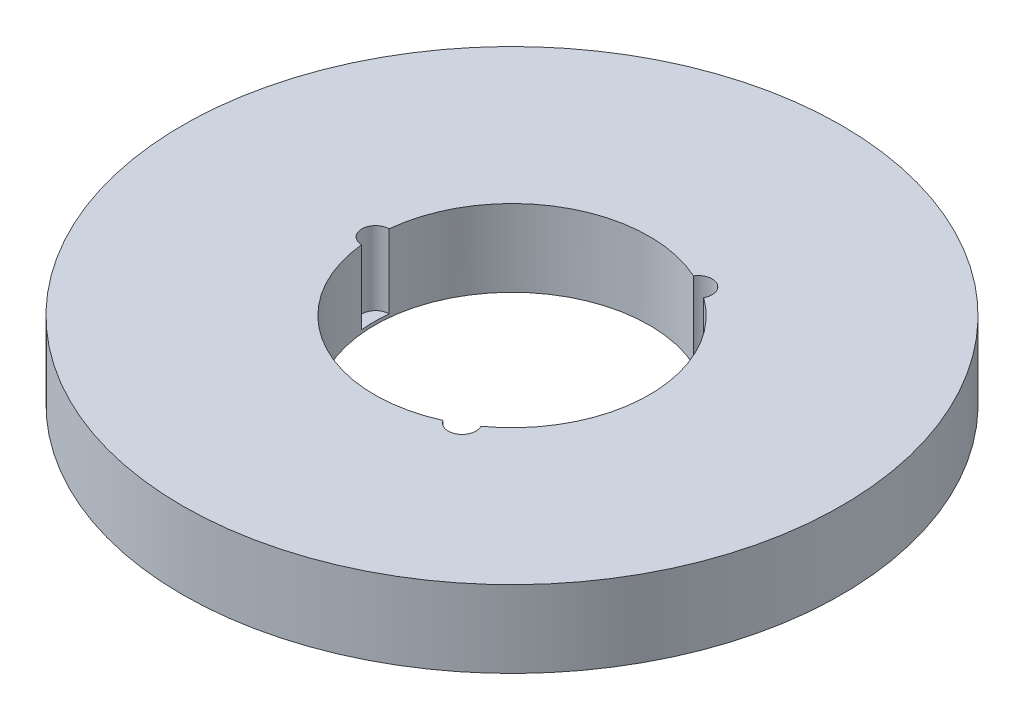
ISO-10303-21;
HEADER;
FILE_DESCRIPTION(('STEP AP214'),'2;1');
FILE_NAME('part.step','',(''),(''),'','','');
FILE_SCHEMA(('AUTOMOTIVE_DESIGN { 1 0 10303 214 1 1 1 1 }'));
ENDSEC;
DATA;
#1=APPLICATION_CONTEXT('core data for automotive mechanical design processes');
#2=APPLICATION_PROTOCOL_DEFINITION('international standard','automotive_design',2000,#1);
#3=PRODUCT_CONTEXT('',#1,'mechanical');
#4=PRODUCT('Part','Part','',(#3));
#5=PRODUCT_RELATED_PRODUCT_CATEGORY('part','',(#4));
#6=PRODUCT_DEFINITION_FORMATION('','',#4);
#7=PRODUCT_DEFINITION_CONTEXT('part definition',#1,'design');
#8=PRODUCT_DEFINITION('design','',#6,#7);
#9=PRODUCT_DEFINITION_SHAPE('','',#8);
#10=(LENGTH_UNIT() NAMED_UNIT(*) SI_UNIT(.MILLI.,.METRE.));
#11=(NAMED_UNIT(*) PLANE_ANGLE_UNIT() SI_UNIT($,.RADIAN.));
#12=(NAMED_UNIT(*) SI_UNIT($,.STERADIAN.) SOLID_ANGLE_UNIT());
#13=UNCERTAINTY_MEASURE_WITH_UNIT(LENGTH_MEASURE(1.E-05),#10,'distance_accuracy_value','');
#14=(GEOMETRIC_REPRESENTATION_CONTEXT(3) GLOBAL_UNCERTAINTY_ASSIGNED_CONTEXT((#13)) GLOBAL_UNIT_ASSIGNED_CONTEXT((#10,
#11,#12)) REPRESENTATION_CONTEXT('',''));
#15=CARTESIAN_POINT('',(0.,0.,0.));
#16=DIRECTION('',(0.,0.,1.));
#17=DIRECTION('',(1.,0.,0.));
#18=AXIS2_PLACEMENT_3D('',#15,#16,#17);
#19=CARTESIAN_POINT('',(0.,14.,0.));
#20=DIRECTION('',(0.,-1.,0.));
#21=DIRECTION('',(0.,0.,-1.));
#22=AXIS2_PLACEMENT_3D('',#19,#20,#21);
#23=CYLINDRICAL_SURFACE('',#22,60.);
#24=CARTESIAN_POINT('',(0.,14.,0.));
#25=DIRECTION('',(0.,1.,0.));
#26=DIRECTION('',(0.,0.,1.));
#27=AXIS2_PLACEMENT_3D('',#24,#25,#26);
#28=CIRCLE('',#27,60.);
#29=CARTESIAN_POINT('',(0.,14.,60.));
#30=VERTEX_POINT('',#29);
#31=EDGE_CURVE('E130',#30,#30,#28,.T.);
#32=ORIENTED_EDGE('',*,*,#31,.F.);
#33=EDGE_LOOP('',(#32));
#34=FACE_BOUND('',#33,.T.);
#35=CARTESIAN_POINT('',(0.,0.,0.));
#36=DIRECTION('',(0.,1.,0.));
#37=DIRECTION('',(0.,0.,1.));
#38=AXIS2_PLACEMENT_3D('',#35,#36,#37);
#39=CIRCLE('',#38,60.);
#40=CARTESIAN_POINT('',(0.,0.,60.));
#41=VERTEX_POINT('',#40);
#42=EDGE_CURVE('E117',#41,#41,#39,.T.);
#43=ORIENTED_EDGE('',*,*,#42,.T.);
#44=EDGE_LOOP('',(#43));
#45=FACE_BOUND('',#44,.T.);
#46=ADVANCED_FACE('F39',(#34,#45),#23,.T.);
#47=CARTESIAN_POINT('',(0.,14.,0.));
#48=DIRECTION('',(0.,1.,0.));
#49=DIRECTION('',(0.,0.,1.));
#50=AXIS2_PLACEMENT_3D('',#47,#48,#49);
#51=PLANE('',#50);
#52=CARTESIAN_POINT('',(12.411815993931,14.,21.4978959156842));
#53=DIRECTION('',(0.,1.,0.));
#54=DIRECTION('',(0.866025403784436,0.,-0.500000000000004));
#55=AXIS2_PLACEMENT_3D('',#52,#53,#54);
#56=CIRCLE('',#55,2.51555012298367);
#57=CARTESIAN_POINT('',(10.2584758562214,14.,22.7983261031884));
#58=VERTEX_POINT('',#57);
#59=CARTESIAN_POINT('',(14.6146916410125,14.,20.2832637471911));
#60=VERTEX_POINT('',#59);
#61=EDGE_CURVE('E148',#58,#60,#56,.T.);
#62=ORIENTED_EDGE('',*,*,#61,.F.);
#63=CARTESIAN_POINT('',(0.,14.,0.));
#64=DIRECTION('',(0.,1.,0.));
#65=DIRECTION('',(0.,0.,1.));
#66=AXIS2_PLACEMENT_3D('',#63,#64,#65);
#67=CIRCLE('',#66,25.);
#68=CARTESIAN_POINT('',(-24.8731674972338,14.,2.51506235599725));
#69=VERTEX_POINT('',#68);
#70=EDGE_CURVE('E113',#69,#58,#67,.T.);
#71=ORIENTED_EDGE('',*,*,#70,.F.);
#72=CARTESIAN_POINT('',(-24.8236319878617,14.,0.));
#73=DIRECTION('',(0.,1.,0.));
#74=DIRECTION('',(0.,0.,1.));
#75=AXIS2_PLACEMENT_3D('',#72,#73,#74);
#76=CIRCLE('',#75,2.51555012298367);
#77=CARTESIAN_POINT('',(-24.8731674972338,14.,-2.51506235599725));
#78=VERTEX_POINT('',#77);
#79=EDGE_CURVE('E125',#78,#69,#76,.T.);
#80=ORIENTED_EDGE('',*,*,#79,.F.);
#81=CARTESIAN_POINT('',(10.2584758562211,14.,-22.7983261031886));
#82=VERTEX_POINT('',#81);
#83=EDGE_CURVE('E107',#82,#78,#67,.T.);
#84=ORIENTED_EDGE('',*,*,#83,.F.);
#85=CARTESIAN_POINT('',(12.4118159939307,14.,-21.4978959156844));
#86=DIRECTION('',(0.,1.,0.));
#87=DIRECTION('',(-0.866025403784443,0.,-0.499999999999992));
#88=AXIS2_PLACEMENT_3D('',#85,#86,#87);
#89=CIRCLE('',#88,2.51555012298367);
#90=CARTESIAN_POINT('',(14.6146916410122,14.,-20.2832637471913));
#91=VERTEX_POINT('',#90);
#92=EDGE_CURVE('E95',#91,#82,#89,.T.);
#93=ORIENTED_EDGE('',*,*,#92,.F.);
#94=EDGE_CURVE('E106',#60,#91,#67,.T.);
#95=ORIENTED_EDGE('',*,*,#94,.F.);
#96=EDGE_LOOP('',(#62,#71,#80,#84,#93,#95));
#97=FACE_BOUND('',#96,.T.);
#98=ORIENTED_EDGE('',*,*,#31,.T.);
#99=EDGE_LOOP('',(#98));
#100=FACE_BOUND('',#99,.T.);
#101=ADVANCED_FACE('F102',(#97,#100),#51,.T.);
#102=CARTESIAN_POINT('',(0.,0.,0.));
#103=DIRECTION('',(0.,1.,0.));
#104=DIRECTION('',(0.,0.,1.));
#105=AXIS2_PLACEMENT_3D('',#102,#103,#104);
#106=PLANE('',#105);
#107=CARTESIAN_POINT('',(0.,0.,0.));
#108=DIRECTION('',(0.,1.,0.));
#109=DIRECTION('',(0.,0.,1.));
#110=AXIS2_PLACEMENT_3D('',#107,#108,#109);
#111=CIRCLE('',#110,25.);
#112=CARTESIAN_POINT('',(0.,0.,25.));
#113=VERTEX_POINT('',#112);
#114=EDGE_CURVE('E118',#113,#113,#111,.T.);
#115=ORIENTED_EDGE('',*,*,#114,.T.);
#116=EDGE_LOOP('',(#115));
#117=FACE_BOUND('',#116,.T.);
#118=ORIENTED_EDGE('',*,*,#42,.F.);
#119=EDGE_LOOP('',(#118));
#120=FACE_BOUND('',#119,.T.);
#121=ADVANCED_FACE('F161',(#117,#120),#106,.F.);
#122=CARTESIAN_POINT('',(0.,14.,0.));
#123=DIRECTION('',(0.,-1.,0.));
#124=DIRECTION('',(0.,0.,-1.));
#125=AXIS2_PLACEMENT_3D('',#122,#123,#124);
#126=CYLINDRICAL_SURFACE('',#125,25.);
#127=DIRECTION('',(0.,1.,0.));
#128=VECTOR('',#127,1.);
#129=CARTESIAN_POINT('',(10.2584758562214,7.29633693983329,22.7983261031884));
#130=LINE('',#129,#128);
#131=CARTESIAN_POINT('',(10.2584758562214,0.592673879666578,22.7983261031884));
#132=VERTEX_POINT('',#131);
#133=EDGE_CURVE('E11',#132,#58,#130,.T.);
#134=ORIENTED_EDGE('',*,*,#133,.F.);
#135=CARTESIAN_POINT('',(0.,0.592673879666578,0.));
#136=DIRECTION('',(0.,1.,0.));
#137=DIRECTION('',(0.,0.,1.));
#138=AXIS2_PLACEMENT_3D('',#135,#136,#137);
#139=CIRCLE('',#138,25.);
#140=CARTESIAN_POINT('',(14.6146916410125,0.592673879666578,20.2832637471911));
#141=VERTEX_POINT('',#140);
#142=EDGE_CURVE('E100',#132,#141,#139,.T.);
#143=ORIENTED_EDGE('',*,*,#142,.T.);
#144=DIRECTION('',(0.,1.,0.));
#145=VECTOR('',#144,1.);
#146=CARTESIAN_POINT('',(14.6146916410125,7.29633693983329,20.2832637471912));
#147=LINE('',#146,#145);
#148=EDGE_CURVE('E46',#60,#141,#147,.F.);
#149=ORIENTED_EDGE('',*,*,#148,.F.);
#150=ORIENTED_EDGE('',*,*,#94,.T.);
#151=DIRECTION('',(0.,1.,0.));
#152=VECTOR('',#151,1.);
#153=CARTESIAN_POINT('',(14.6146916410123,7.29633693983329,-20.2832637471914));
#154=LINE('',#153,#152);
#155=CARTESIAN_POINT('',(14.6146916410122,0.592673879666578,-20.2832637471913));
#156=VERTEX_POINT('',#155);
#157=EDGE_CURVE('E90',#156,#91,#154,.T.);
#158=ORIENTED_EDGE('',*,*,#157,.F.);
#159=CARTESIAN_POINT('',(0.,0.592673879666578,0.));
#160=DIRECTION('',(0.,1.,0.));
#161=DIRECTION('',(0.,0.,1.));
#162=AXIS2_PLACEMENT_3D('',#159,#160,#161);
#163=CIRCLE('',#162,25.);
#164=CARTESIAN_POINT('',(10.2584758562211,0.592673879666578,-22.7983261031886));
#165=VERTEX_POINT('',#164);
#166=EDGE_CURVE('E143',#156,#165,#163,.T.);
#167=ORIENTED_EDGE('',*,*,#166,.T.);
#168=DIRECTION('',(0.,1.,0.));
#169=VECTOR('',#168,1.);
#170=CARTESIAN_POINT('',(10.2584758562211,7.29633693983329,-22.7983261031886));
#171=LINE('',#170,#169);
#172=EDGE_CURVE('E98',#82,#165,#171,.F.);
#173=ORIENTED_EDGE('',*,*,#172,.F.);
#174=ORIENTED_EDGE('',*,*,#83,.T.);
#175=DIRECTION('',(0.,1.,0.));
#176=VECTOR('',#175,1.);
#177=CARTESIAN_POINT('',(-24.8731674972338,7.29633693983329,-2.51506235599725));
#178=LINE('',#177,#176);
#179=CARTESIAN_POINT('',(-24.8731674972338,0.592673879666578,-2.51506235599725));
#180=VERTEX_POINT('',#179);
#181=EDGE_CURVE('E137',#180,#78,#178,.T.);
#182=ORIENTED_EDGE('',*,*,#181,.F.);
#183=CARTESIAN_POINT('',(0.,0.592673879666578,0.));
#184=DIRECTION('',(0.,1.,0.));
#185=DIRECTION('',(0.,0.,1.));
#186=AXIS2_PLACEMENT_3D('',#183,#184,#185);
#187=CIRCLE('',#186,25.);
#188=CARTESIAN_POINT('',(-24.8731674972338,0.592673879666578,2.51506235599725));
#189=VERTEX_POINT('',#188);
#190=EDGE_CURVE('E128',#180,#189,#187,.T.);
#191=ORIENTED_EDGE('',*,*,#190,.T.);
#192=DIRECTION('',(0.,1.,0.));
#193=VECTOR('',#192,1.);
#194=CARTESIAN_POINT('',(-24.8731674972338,7.29633693983329,2.51506235599725));
#195=LINE('',#194,#193);
#196=EDGE_CURVE('E134',#69,#189,#195,.F.);
#197=ORIENTED_EDGE('',*,*,#196,.F.);
#198=ORIENTED_EDGE('',*,*,#70,.T.);
#199=EDGE_LOOP('',(#134,#143,#149,#150,#158,#167,#173,#174,#182,#191,#197,#198));
#200=FACE_BOUND('',#199,.T.);
#201=ORIENTED_EDGE('',*,*,#114,.F.);
#202=EDGE_LOOP('',(#201));
#203=FACE_BOUND('',#202,.T.);
#204=ADVANCED_FACE('F115',(#200,#203),#126,.F.);
#205=CARTESIAN_POINT('',(-24.8236319878617,0.592673879666578,0.));
#206=DIRECTION('',(0.,1.,0.));
#207=DIRECTION('',(0.,0.,1.));
#208=AXIS2_PLACEMENT_3D('',#205,#206,#207);
#209=CYLINDRICAL_SURFACE('',#208,2.51555012298367);
#210=ORIENTED_EDGE('',*,*,#181,.T.);
#211=ORIENTED_EDGE('',*,*,#79,.T.);
#212=ORIENTED_EDGE('',*,*,#196,.T.);
#213=CARTESIAN_POINT('',(-24.8236319878617,0.592673879666578,0.));
#214=DIRECTION('',(0.,1.,0.));
#215=DIRECTION('',(0.,0.,1.));
#216=AXIS2_PLACEMENT_3D('',#213,#214,#215);
#217=CIRCLE('',#216,2.51555012298367);
#218=EDGE_CURVE('E127',#180,#189,#217,.T.);
#219=ORIENTED_EDGE('',*,*,#218,.F.);
#220=EDGE_LOOP('',(#210,#211,#212,#219));
#221=FACE_BOUND('',#220,.T.);
#222=ADVANCED_FACE('F175',(#221),#209,.F.);
#223=CARTESIAN_POINT('',(-24.8236319878617,0.592673879666578,0.));
#224=DIRECTION('',(0.,1.,0.));
#225=DIRECTION('',(0.,0.,1.));
#226=AXIS2_PLACEMENT_3D('',#223,#224,#225);
#227=PLANE('',#226);
#228=ORIENTED_EDGE('',*,*,#218,.T.);
#229=ORIENTED_EDGE('',*,*,#190,.F.);
#230=EDGE_LOOP('',(#228,#229));
#231=FACE_BOUND('',#230,.T.);
#232=ADVANCED_FACE('F176',(#231),#227,.T.);
#233=CARTESIAN_POINT('',(12.4118159939307,0.592673879666578,-21.4978959156844));
#234=DIRECTION('',(0.,1.,0.));
#235=DIRECTION('',(0.,0.,1.));
#236=AXIS2_PLACEMENT_3D('',#233,#234,#235);
#237=CYLINDRICAL_SURFACE('',#236,2.51555012298367);
#238=ORIENTED_EDGE('',*,*,#157,.T.);
#239=ORIENTED_EDGE('',*,*,#92,.T.);
#240=ORIENTED_EDGE('',*,*,#172,.T.);
#241=CARTESIAN_POINT('',(12.4118159939307,0.592673879666578,-21.4978959156844));
#242=DIRECTION('',(0.,1.,0.));
#243=DIRECTION('',(-0.866025403784443,0.,-0.499999999999992));
#244=AXIS2_PLACEMENT_3D('',#241,#242,#243);
#245=CIRCLE('',#244,2.51555012298367);
#246=EDGE_CURVE('E56',#156,#165,#245,.T.);
#247=ORIENTED_EDGE('',*,*,#246,.F.);
#248=EDGE_LOOP('',(#238,#239,#240,#247));
#249=FACE_BOUND('',#248,.T.);
#250=ADVANCED_FACE('F93',(#249),#237,.F.);
#251=CARTESIAN_POINT('',(12.4118159939307,0.592673879666578,-21.4978959156844));
#252=DIRECTION('',(0.,1.,0.));
#253=DIRECTION('',(-0.866025403784443,0.,-0.499999999999992));
#254=AXIS2_PLACEMENT_3D('',#251,#252,#253);
#255=PLANE('',#254);
#256=ORIENTED_EDGE('',*,*,#246,.T.);
#257=ORIENTED_EDGE('',*,*,#166,.F.);
#258=EDGE_LOOP('',(#256,#257));
#259=FACE_BOUND('',#258,.T.);
#260=ADVANCED_FACE('F153',(#259),#255,.T.);
#261=CARTESIAN_POINT('',(12.411815993931,0.592673879666578,21.4978959156842));
#262=DIRECTION('',(0.,1.,0.));
#263=DIRECTION('',(0.,0.,1.));
#264=AXIS2_PLACEMENT_3D('',#261,#262,#263);
#265=CYLINDRICAL_SURFACE('',#264,2.51555012298367);
#266=ORIENTED_EDGE('',*,*,#133,.T.);
#267=ORIENTED_EDGE('',*,*,#61,.T.);
#268=ORIENTED_EDGE('',*,*,#148,.T.);
#269=CARTESIAN_POINT('',(12.411815993931,0.592673879666578,21.4978959156842));
#270=DIRECTION('',(0.,1.,0.));
#271=DIRECTION('',(0.866025403784436,0.,-0.500000000000004));
#272=AXIS2_PLACEMENT_3D('',#269,#270,#271);
#273=CIRCLE('',#272,2.51555012298367);
#274=EDGE_CURVE('E55',#132,#141,#273,.T.);
#275=ORIENTED_EDGE('',*,*,#274,.F.);
#276=EDGE_LOOP('',(#266,#267,#268,#275));
#277=FACE_BOUND('',#276,.T.);
#278=ADVANCED_FACE('F144',(#277),#265,.F.);
#279=CARTESIAN_POINT('',(12.411815993931,0.592673879666578,21.4978959156842));
#280=DIRECTION('',(0.,1.,0.));
#281=DIRECTION('',(0.866025403784436,0.,-0.500000000000004));
#282=AXIS2_PLACEMENT_3D('',#279,#280,#281);
#283=PLANE('',#282);
#284=ORIENTED_EDGE('',*,*,#274,.T.);
#285=ORIENTED_EDGE('',*,*,#142,.F.);
#286=EDGE_LOOP('',(#284,#285));
#287=FACE_BOUND('',#286,.T.);
#288=ADVANCED_FACE('F150',(#287),#283,.T.);
#289=CLOSED_SHELL('',(#46,#101,#121,#204,#222,#232,#250,#260,#278,#288));
#290=MANIFOLD_SOLID_BREP('B2',#289);
#291=ADVANCED_BREP_SHAPE_REPRESENTATION('',(#18,#290),#14);
#292=SHAPE_DEFINITION_REPRESENTATION(#9,#291);
ENDSEC;
END-ISO-10303-21;
